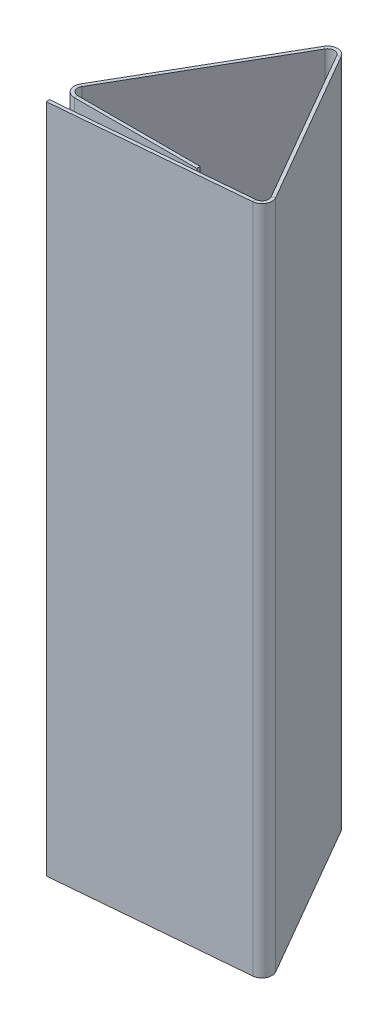
ISO-10303-21;
HEADER;
FILE_DESCRIPTION(('STEP AP214'),'2;1');
FILE_NAME('part.step','',(''),(''),'','','');
FILE_SCHEMA(('AUTOMOTIVE_DESIGN { 1 0 10303 214 1 1 1 1 }'));
ENDSEC;
DATA;
#1=APPLICATION_CONTEXT('core data for automotive mechanical design processes');
#2=APPLICATION_PROTOCOL_DEFINITION('international standard','automotive_design',2000,#1);
#3=PRODUCT_CONTEXT('',#1,'mechanical');
#4=PRODUCT('Part','Part','',(#3));
#5=PRODUCT_RELATED_PRODUCT_CATEGORY('part','',(#4));
#6=PRODUCT_DEFINITION_FORMATION('','',#4);
#7=PRODUCT_DEFINITION_CONTEXT('part definition',#1,'design');
#8=PRODUCT_DEFINITION('design','',#6,#7);
#9=PRODUCT_DEFINITION_SHAPE('','',#8);
#10=(LENGTH_UNIT() NAMED_UNIT(*) SI_UNIT(.MILLI.,.METRE.));
#11=(NAMED_UNIT(*) PLANE_ANGLE_UNIT() SI_UNIT($,.RADIAN.));
#12=(NAMED_UNIT(*) SI_UNIT($,.STERADIAN.) SOLID_ANGLE_UNIT());
#13=UNCERTAINTY_MEASURE_WITH_UNIT(LENGTH_MEASURE(1.E-05),#10,'distance_accuracy_value','');
#14=(GEOMETRIC_REPRESENTATION_CONTEXT(3) GLOBAL_UNCERTAINTY_ASSIGNED_CONTEXT((#13)) GLOBAL_UNIT_ASSIGNED_CONTEXT((#10,
#11,#12)) REPRESENTATION_CONTEXT('',''));
#15=CARTESIAN_POINT('',(0.,0.,0.));
#16=DIRECTION('',(0.,0.,1.));
#17=DIRECTION('',(1.,0.,0.));
#18=AXIS2_PLACEMENT_3D('',#15,#16,#17);
#19=CARTESIAN_POINT('',(14.6075786057206,50.,-0.679693792868908));
#20=DIRECTION('',(0.,1.,0.));
#21=DIRECTION('',(0.,0.,1.));
#22=AXIS2_PLACEMENT_3D('',#19,#20,#21);
#23=PLANE('',#22);
#24=DIRECTION('',(0.866025403784442,0.,-0.499999999999993));
#25=VECTOR('',#24,1.);
#26=CARTESIAN_POINT('',(14.6075786057206,50.,-0.679693792868908));
#27=LINE('',#26,#25);
#28=CARTESIAN_POINT('',(14.6075786057206,50.,-0.679693792868908));
#29=VERTEX_POINT('',#28);
#30=CARTESIAN_POINT('',(14.8240849566667,50.,-0.804693792868906));
#31=VERTEX_POINT('',#30);
#32=EDGE_CURVE('E11',#29,#31,#27,.T.);
#33=ORIENTED_EDGE('',*,*,#32,.F.);
#34=CARTESIAN_POINT('',(14.1745659038283,50.,-0.429693792868902));
#35=DIRECTION('',(0.,-1.,0.));
#36=DIRECTION('',(0.,0.,-1.));
#37=AXIS2_PLACEMENT_3D('',#34,#35,#36);
#38=CIRCLE('',#37,0.5);
#39=CARTESIAN_POINT('',(14.2181437752022,50.,0.0684035561769696));
#40=VERTEX_POINT('',#39);
#41=EDGE_CURVE('E308',#40,#29,#38,.F.);
#42=ORIENTED_EDGE('',*,*,#41,.F.);
#43=DIRECTION('',(-0.0871557427476462,0.,-0.996194698091747));
#44=VECTOR('',#43,1.);
#45=CARTESIAN_POINT('',(14.2399327108891,50.,0.317452230699908));
#46=LINE('',#45,#44);
#47=CARTESIAN_POINT('',(14.2399327108891,50.,0.317452230699908));
#48=VERTEX_POINT('',#47);
#49=EDGE_CURVE('E43',#48,#40,#46,.T.);
#50=ORIENTED_EDGE('',*,*,#49,.F.);
#51=CARTESIAN_POINT('',(14.1745659038283,50.,-0.429693792868902));
#52=DIRECTION('',(0.,1.,0.));
#53=DIRECTION('',(1.,0.,0.));
#54=AXIS2_PLACEMENT_3D('',#51,#52,#53);
#55=CIRCLE('',#54,0.75);
#56=EDGE_CURVE('E321',#48,#31,#55,.T.);
#57=ORIENTED_EDGE('',*,*,#56,.T.);
#58=EDGE_LOOP('',(#33,#42,#50,#57));
#59=FACE_BOUND('',#58,.T.);
#60=ADVANCED_FACE('F35',(#59),#23,.T.);
#61=CARTESIAN_POINT('',(14.2399327108891,50.,0.317452230699908));
#62=DIRECTION('',(0.,1.,0.));
#63=DIRECTION('',(0.,0.,1.));
#64=AXIS2_PLACEMENT_3D('',#61,#62,#63);
#65=PLANE('',#64);
#66=DIRECTION('',(-0.499999999999998,0.,-0.86602540378444));
#67=VECTOR('',#66,1.);
#68=CARTESIAN_POINT('',(7.49999999999997,50.,-12.9903810567666));
#69=LINE('',#68,#67);
#70=CARTESIAN_POINT('',(7.93301270189219,50.,-12.2403810567666));
#71=VERTEX_POINT('',#70);
#72=EDGE_CURVE('E312',#29,#71,#69,.T.);
#73=ORIENTED_EDGE('',*,*,#72,.F.);
#74=ORIENTED_EDGE('',*,*,#32,.T.);
#75=DIRECTION('',(-0.499999999999998,0.,-0.86602540378444));
#76=VECTOR('',#75,1.);
#77=CARTESIAN_POINT('',(7.71650635094608,50.,-13.1153810567666));
#78=LINE('',#77,#76);
#79=CARTESIAN_POINT('',(8.1495190528383,50.,-12.3653810567666));
#80=VERTEX_POINT('',#79);
#81=EDGE_CURVE('E178',#31,#80,#78,.T.);
#82=ORIENTED_EDGE('',*,*,#81,.T.);
#83=DIRECTION('',(-0.866025403784439,0.,0.499999999999998));
#84=VECTOR('',#83,1.);
#85=CARTESIAN_POINT('',(8.1495190528383,50.,-12.3653810567666));
#86=LINE('',#85,#84);
#87=EDGE_CURVE('E169',#80,#71,#86,.T.);
#88=ORIENTED_EDGE('',*,*,#87,.T.);
#89=EDGE_LOOP('',(#73,#74,#82,#88));
#90=FACE_BOUND('',#89,.T.);
#91=ADVANCED_FACE('F326',(#90),#65,.T.);
#92=CARTESIAN_POINT('',(14.2181437752022,0.,0.0684035561769696));
#93=DIRECTION('',(0.,-1.,0.));
#94=DIRECTION('',(0.,0.,-1.));
#95=AXIS2_PLACEMENT_3D('',#92,#93,#94);
#96=PLANE('',#95);
#97=DIRECTION('',(0.0871557427476462,0.,0.996194698091747));
#98=VECTOR('',#97,1.);
#99=CARTESIAN_POINT('',(14.2181437752022,0.,0.0684035561769696));
#100=LINE('',#99,#98);
#101=CARTESIAN_POINT('',(14.2181437752022,0.,0.0684035561769696));
#102=VERTEX_POINT('',#101);
#103=CARTESIAN_POINT('',(14.2399327108891,0.,0.317452230699908));
#104=VERTEX_POINT('',#103);
#105=EDGE_CURVE('E288',#102,#104,#100,.T.);
#106=ORIENTED_EDGE('',*,*,#105,.F.);
#107=CARTESIAN_POINT('',(14.1745659038283,0.,-0.429693792868902));
#108=DIRECTION('',(0.,-1.,0.));
#109=DIRECTION('',(0.,0.,-1.));
#110=AXIS2_PLACEMENT_3D('',#107,#108,#109);
#111=CIRCLE('',#110,0.5);
#112=CARTESIAN_POINT('',(14.6075786057206,0.,-0.679693792868908));
#113=VERTEX_POINT('',#112);
#114=EDGE_CURVE('E218',#102,#113,#111,.F.);
#115=ORIENTED_EDGE('',*,*,#114,.T.);
#116=DIRECTION('',(-0.866025403784442,0.,0.499999999999993));
#117=VECTOR('',#116,1.);
#118=CARTESIAN_POINT('',(14.8240849566667,0.,-0.804693792868906));
#119=LINE('',#118,#117);
#120=CARTESIAN_POINT('',(14.8240849566667,0.,-0.804693792868906));
#121=VERTEX_POINT('',#120);
#122=EDGE_CURVE('E168',#121,#113,#119,.T.);
#123=ORIENTED_EDGE('',*,*,#122,.F.);
#124=CARTESIAN_POINT('',(14.1745659038283,0.,-0.429693792868902));
#125=DIRECTION('',(0.,1.,0.));
#126=DIRECTION('',(1.,0.,0.));
#127=AXIS2_PLACEMENT_3D('',#124,#125,#126);
#128=CIRCLE('',#127,0.75);
#129=EDGE_CURVE('E230',#104,#121,#128,.T.);
#130=ORIENTED_EDGE('',*,*,#129,.F.);
#131=EDGE_LOOP('',(#106,#115,#123,#130));
#132=FACE_BOUND('',#131,.T.);
#133=ADVANCED_FACE('F378',(#132),#96,.T.);
#134=CARTESIAN_POINT('',(14.8240849566667,0.,-0.804693792868906));
#135=DIRECTION('',(0.,-1.,0.));
#136=DIRECTION('',(0.,0.,-1.));
#137=AXIS2_PLACEMENT_3D('',#134,#135,#136);
#138=PLANE('',#137);
#139=DIRECTION('',(0.996194698091746,0.,-0.0871557427476513));
#140=VECTOR('',#139,1.);
#141=CARTESIAN_POINT('',(14.9999999999999,0.,0.));
#142=LINE('',#141,#140);
#143=CARTESIAN_POINT('',(0.0570795286237505,0.,1.30733614121476));
#144=VERTEX_POINT('',#143);
#145=EDGE_CURVE('E221',#144,#102,#142,.T.);
#146=ORIENTED_EDGE('',*,*,#145,.T.);
#147=ORIENTED_EDGE('',*,*,#105,.T.);
#148=DIRECTION('',(0.996194698091746,0.,-0.0871557427476513));
#149=VECTOR('',#148,1.);
#150=CARTESIAN_POINT('',(15.0217889356869,0.,0.249048674522931));
#151=LINE('',#150,#149);
#152=CARTESIAN_POINT('',(0.0788684643106621,0.,1.5563848157377));
#153=VERTEX_POINT('',#152);
#154=EDGE_CURVE('E227',#153,#104,#151,.T.);
#155=ORIENTED_EDGE('',*,*,#154,.F.);
#156=DIRECTION('',(-0.0871557427476467,0.,-0.996194698091747));
#157=VECTOR('',#156,1.);
#158=CARTESIAN_POINT('',(0.0788684643106621,0.,1.5563848157377));
#159=LINE('',#158,#157);
#160=EDGE_CURVE('E224',#153,#144,#159,.T.);
#161=ORIENTED_EDGE('',*,*,#160,.T.);
#162=EDGE_LOOP('',(#146,#147,#155,#161));
#163=FACE_BOUND('',#162,.T.);
#164=ADVANCED_FACE('F382',(#163),#138,.T.);
#165=CARTESIAN_POINT('',(7.06698729810775,50.,-12.2403810567666));
#166=DIRECTION('',(0.,1.,0.));
#167=DIRECTION('',(0.,0.,1.));
#168=AXIS2_PLACEMENT_3D('',#165,#166,#167);
#169=PLANE('',#168);
#170=DIRECTION('',(-0.866025403784436,0.,-0.500000000000005));
#171=VECTOR('',#170,1.);
#172=CARTESIAN_POINT('',(7.06698729810775,50.,-12.2403810567666));
#173=LINE('',#172,#171);
#174=CARTESIAN_POINT('',(7.06698729810775,50.,-12.2403810567666));
#175=VERTEX_POINT('',#174);
#176=CARTESIAN_POINT('',(6.85048094716164,50.,-12.3653810567666));
#177=VERTEX_POINT('',#176);
#178=EDGE_CURVE('E156',#175,#177,#173,.T.);
#179=ORIENTED_EDGE('',*,*,#178,.F.);
#180=CARTESIAN_POINT('',(7.49999999999997,50.,-11.9903810567666));
#181=DIRECTION('',(0.,-1.,0.));
#182=DIRECTION('',(0.,0.,-1.));
#183=AXIS2_PLACEMENT_3D('',#180,#181,#182);
#184=CIRCLE('',#183,0.5);
#185=EDGE_CURVE('E338',#71,#175,#184,.F.);
#186=ORIENTED_EDGE('',*,*,#185,.F.);
#187=ORIENTED_EDGE('',*,*,#87,.F.);
#188=CARTESIAN_POINT('',(7.49999999999997,50.,-11.9903810567666));
#189=DIRECTION('',(0.,1.,0.));
#190=DIRECTION('',(1.,0.,0.));
#191=AXIS2_PLACEMENT_3D('',#188,#189,#190);
#192=CIRCLE('',#191,0.75);
#193=EDGE_CURVE('E172',#80,#177,#192,.T.);
#194=ORIENTED_EDGE('',*,*,#193,.T.);
#195=EDGE_LOOP('',(#179,#186,#187,#194));
#196=FACE_BOUND('',#195,.T.);
#197=ADVANCED_FACE('F174',(#196),#169,.T.);
#198=CARTESIAN_POINT('',(8.1495190528383,50.,-12.3653810567666));
#199=DIRECTION('',(0.,1.,0.));
#200=DIRECTION('',(0.,0.,1.));
#201=AXIS2_PLACEMENT_3D('',#198,#199,#200);
#202=PLANE('',#201);
#203=DIRECTION('',(-0.499999999999998,0.,0.86602540378444));
#204=VECTOR('',#203,1.);
#205=CARTESIAN_POINT('',(0.,50.,0.));
#206=LINE('',#205,#204);
#207=CARTESIAN_POINT('',(0.433012701892216,50.,-0.749999999999999));
#208=VERTEX_POINT('',#207);
#209=EDGE_CURVE('E163',#175,#208,#206,.T.);
#210=ORIENTED_EDGE('',*,*,#209,.F.);
#211=ORIENTED_EDGE('',*,*,#178,.T.);
#212=DIRECTION('',(-0.499999999999998,0.,0.86602540378444));
#213=VECTOR('',#212,1.);
#214=CARTESIAN_POINT('',(-0.21650635094611,50.,-0.124999999999999));
#215=LINE('',#214,#213);
#216=CARTESIAN_POINT('',(0.216506350946106,50.,-0.874999999999998));
#217=VERTEX_POINT('',#216);
#218=EDGE_CURVE('E160',#177,#217,#215,.T.);
#219=ORIENTED_EDGE('',*,*,#218,.T.);
#220=DIRECTION('',(0.86602540378444,0.,0.499999999999997));
#221=VECTOR('',#220,1.);
#222=CARTESIAN_POINT('',(0.216506350946106,50.,-0.874999999999998));
#223=LINE('',#222,#221);
#224=EDGE_CURVE('E279',#217,#208,#223,.T.);
#225=ORIENTED_EDGE('',*,*,#224,.T.);
#226=EDGE_LOOP('',(#210,#211,#219,#225));
#227=FACE_BOUND('',#226,.T.);
#228=ADVANCED_FACE('F158',(#227),#202,.T.);
#229=CARTESIAN_POINT('',(7.93301270189219,0.,-12.2403810567666));
#230=DIRECTION('',(0.,-1.,0.));
#231=DIRECTION('',(0.,0.,-1.));
#232=AXIS2_PLACEMENT_3D('',#229,#230,#231);
#233=PLANE('',#232);
#234=DIRECTION('',(0.866025403784439,0.,-0.499999999999998));
#235=VECTOR('',#234,1.);
#236=CARTESIAN_POINT('',(7.93301270189219,0.,-12.2403810567666));
#237=LINE('',#236,#235);
#238=CARTESIAN_POINT('',(7.93301270189219,0.,-12.2403810567666));
#239=VERTEX_POINT('',#238);
#240=CARTESIAN_POINT('',(8.1495190528383,0.,-12.3653810567666));
#241=VERTEX_POINT('',#240);
#242=EDGE_CURVE('E284',#239,#241,#237,.T.);
#243=ORIENTED_EDGE('',*,*,#242,.F.);
#244=CARTESIAN_POINT('',(7.49999999999997,0.,-11.9903810567666));
#245=DIRECTION('',(0.,-1.,0.));
#246=DIRECTION('',(0.,0.,-1.));
#247=AXIS2_PLACEMENT_3D('',#244,#245,#246);
#248=CIRCLE('',#247,0.5);
#249=CARTESIAN_POINT('',(7.06698729810775,0.,-12.2403810567666));
#250=VERTEX_POINT('',#249);
#251=EDGE_CURVE('E212',#239,#250,#248,.F.);
#252=ORIENTED_EDGE('',*,*,#251,.T.);
#253=DIRECTION('',(0.866025403784436,0.,0.500000000000005));
#254=VECTOR('',#253,1.);
#255=CARTESIAN_POINT('',(6.85048094716164,0.,-12.3653810567666));
#256=LINE('',#255,#254);
#257=CARTESIAN_POINT('',(6.85048094716164,0.,-12.3653810567666));
#258=VERTEX_POINT('',#257);
#259=EDGE_CURVE('E282',#258,#250,#256,.T.);
#260=ORIENTED_EDGE('',*,*,#259,.F.);
#261=CARTESIAN_POINT('',(7.49999999999997,0.,-11.9903810567666));
#262=DIRECTION('',(0.,1.,0.));
#263=DIRECTION('',(1.,0.,0.));
#264=AXIS2_PLACEMENT_3D('',#261,#262,#263);
#265=CIRCLE('',#264,0.75);
#266=EDGE_CURVE('E185',#241,#258,#265,.T.);
#267=ORIENTED_EDGE('',*,*,#266,.F.);
#268=EDGE_LOOP('',(#243,#252,#260,#267));
#269=FACE_BOUND('',#268,.T.);
#270=ADVANCED_FACE('F332',(#269),#233,.T.);
#271=CARTESIAN_POINT('',(6.85048094716164,0.,-12.3653810567666));
#272=DIRECTION('',(0.,-1.,0.));
#273=DIRECTION('',(0.,0.,-1.));
#274=AXIS2_PLACEMENT_3D('',#271,#272,#273);
#275=PLANE('',#274);
#276=DIRECTION('',(-0.499999999999998,0.,-0.86602540378444));
#277=VECTOR('',#276,1.);
#278=CARTESIAN_POINT('',(7.49999999999997,0.,-12.9903810567666));
#279=LINE('',#278,#277);
#280=EDGE_CURVE('E215',#113,#239,#279,.T.);
#281=ORIENTED_EDGE('',*,*,#280,.T.);
#282=ORIENTED_EDGE('',*,*,#242,.T.);
#283=DIRECTION('',(-0.499999999999998,0.,-0.86602540378444));
#284=VECTOR('',#283,1.);
#285=CARTESIAN_POINT('',(7.71650635094608,0.,-13.1153810567666));
#286=LINE('',#285,#284);
#287=EDGE_CURVE('E233',#121,#241,#286,.T.);
#288=ORIENTED_EDGE('',*,*,#287,.F.);
#289=ORIENTED_EDGE('',*,*,#122,.T.);
#290=EDGE_LOOP('',(#281,#282,#288,#289));
#291=FACE_BOUND('',#290,.T.);
#292=ADVANCED_FACE('F390',(#291),#275,.T.);
#293=CARTESIAN_POINT('',(0.866025403784436,50.,0.));
#294=DIRECTION('',(0.,1.,0.));
#295=DIRECTION('',(0.,0.,1.));
#296=AXIS2_PLACEMENT_3D('',#293,#294,#295);
#297=PLANE('',#296);
#298=DIRECTION('',(0.,0.,1.));
#299=VECTOR('',#298,1.);
#300=CARTESIAN_POINT('',(0.866025403784436,50.,0.));
#301=LINE('',#300,#299);
#302=CARTESIAN_POINT('',(0.866025403784436,50.,0.));
#303=VERTEX_POINT('',#302);
#304=CARTESIAN_POINT('',(0.866025403784436,50.,0.25));
#305=VERTEX_POINT('',#304);
#306=EDGE_CURVE('E51',#303,#305,#301,.T.);
#307=ORIENTED_EDGE('',*,*,#306,.F.);
#308=CARTESIAN_POINT('',(0.866025403784436,50.,-0.5));
#309=DIRECTION('',(0.,-1.,0.));
#310=DIRECTION('',(0.,0.,-1.));
#311=AXIS2_PLACEMENT_3D('',#308,#309,#310);
#312=CIRCLE('',#311,0.5);
#313=EDGE_CURVE('E366',#208,#303,#312,.F.);
#314=ORIENTED_EDGE('',*,*,#313,.F.);
#315=ORIENTED_EDGE('',*,*,#224,.F.);
#316=CARTESIAN_POINT('',(0.866025403784436,50.,-0.5));
#317=DIRECTION('',(0.,1.,0.));
#318=DIRECTION('',(1.,0.,0.));
#319=AXIS2_PLACEMENT_3D('',#316,#317,#318);
#320=CIRCLE('',#319,0.75);
#321=EDGE_CURVE('E193',#217,#305,#320,.T.);
#322=ORIENTED_EDGE('',*,*,#321,.T.);
#323=EDGE_LOOP('',(#307,#314,#315,#322));
#324=FACE_BOUND('',#323,.T.);
#325=ADVANCED_FACE('F392',(#324),#297,.T.);
#326=CARTESIAN_POINT('',(0.216506350946106,50.,-0.874999999999998));
#327=DIRECTION('',(0.,1.,0.));
#328=DIRECTION('',(0.,0.,1.));
#329=AXIS2_PLACEMENT_3D('',#326,#327,#328);
#330=PLANE('',#329);
#331=DIRECTION('',(1.,0.,0.));
#332=VECTOR('',#331,1.);
#333=CARTESIAN_POINT('',(0.,50.,0.));
#334=LINE('',#333,#332);
#335=CARTESIAN_POINT('',(10.,50.,0.));
#336=VERTEX_POINT('',#335);
#337=EDGE_CURVE('E364',#303,#336,#334,.T.);
#338=ORIENTED_EDGE('',*,*,#337,.F.);
#339=ORIENTED_EDGE('',*,*,#306,.T.);
#340=DIRECTION('',(1.,0.,0.));
#341=VECTOR('',#340,1.);
#342=CARTESIAN_POINT('',(0.,50.,0.25));
#343=LINE('',#342,#341);
#344=CARTESIAN_POINT('',(10.,50.,0.25));
#345=VERTEX_POINT('',#344);
#346=EDGE_CURVE('E117',#305,#345,#343,.T.);
#347=ORIENTED_EDGE('',*,*,#346,.T.);
#348=DIRECTION('',(0.,0.,1.));
#349=VECTOR('',#348,1.);
#350=CARTESIAN_POINT('',(10.,50.,0.));
#351=LINE('',#350,#349);
#352=EDGE_CURVE('E362',#336,#345,#351,.T.);
#353=ORIENTED_EDGE('',*,*,#352,.F.);
#354=EDGE_LOOP('',(#338,#339,#347,#353));
#355=FACE_BOUND('',#354,.T.);
#356=ADVANCED_FACE('F398',(#355),#330,.T.);
#357=CARTESIAN_POINT('',(0.433012701892216,0.,-0.749999999999999));
#358=DIRECTION('',(0.,-1.,0.));
#359=DIRECTION('',(0.,0.,-1.));
#360=AXIS2_PLACEMENT_3D('',#357,#358,#359);
#361=PLANE('',#360);
#362=DIRECTION('',(-0.86602540378444,0.,-0.499999999999997));
#363=VECTOR('',#362,1.);
#364=CARTESIAN_POINT('',(0.433012701892216,0.,-0.749999999999999));
#365=LINE('',#364,#363);
#366=CARTESIAN_POINT('',(0.433012701892216,0.,-0.749999999999999));
#367=VERTEX_POINT('',#366);
#368=CARTESIAN_POINT('',(0.216506350946106,0.,-0.874999999999998));
#369=VERTEX_POINT('',#368);
#370=EDGE_CURVE('E104',#367,#369,#365,.T.);
#371=ORIENTED_EDGE('',*,*,#370,.F.);
#372=CARTESIAN_POINT('',(0.866025403784436,0.,-0.5));
#373=DIRECTION('',(0.,-1.,0.));
#374=DIRECTION('',(0.,0.,-1.));
#375=AXIS2_PLACEMENT_3D('',#372,#373,#374);
#376=CIRCLE('',#375,0.5);
#377=CARTESIAN_POINT('',(0.866025403784436,0.,0.));
#378=VERTEX_POINT('',#377);
#379=EDGE_CURVE('E208',#367,#378,#376,.F.);
#380=ORIENTED_EDGE('',*,*,#379,.T.);
#381=DIRECTION('',(0.,0.,-1.));
#382=VECTOR('',#381,1.);
#383=CARTESIAN_POINT('',(0.866025403784436,0.,0.25));
#384=LINE('',#383,#382);
#385=CARTESIAN_POINT('',(0.866025403784436,0.,0.25));
#386=VERTEX_POINT('',#385);
#387=EDGE_CURVE('E111',#386,#378,#384,.T.);
#388=ORIENTED_EDGE('',*,*,#387,.F.);
#389=CARTESIAN_POINT('',(0.866025403784436,0.,-0.5));
#390=DIRECTION('',(0.,1.,0.));
#391=DIRECTION('',(1.,0.,0.));
#392=AXIS2_PLACEMENT_3D('',#389,#390,#391);
#393=CIRCLE('',#392,0.75);
#394=EDGE_CURVE('E239',#369,#386,#393,.T.);
#395=ORIENTED_EDGE('',*,*,#394,.F.);
#396=EDGE_LOOP('',(#371,#380,#388,#395));
#397=FACE_BOUND('',#396,.T.);
#398=ADVANCED_FACE('F349',(#397),#361,.T.);
#399=CARTESIAN_POINT('',(0.866025403784436,0.,0.25));
#400=DIRECTION('',(0.,-1.,0.));
#401=DIRECTION('',(0.,0.,-1.));
#402=AXIS2_PLACEMENT_3D('',#399,#400,#401);
#403=PLANE('',#402);
#404=DIRECTION('',(-0.499999999999998,0.,0.86602540378444));
#405=VECTOR('',#404,1.);
#406=CARTESIAN_POINT('',(0.,0.,0.));
#407=LINE('',#406,#405);
#408=EDGE_CURVE('E210',#250,#367,#407,.T.);
#409=ORIENTED_EDGE('',*,*,#408,.T.);
#410=ORIENTED_EDGE('',*,*,#370,.T.);
#411=DIRECTION('',(-0.499999999999998,0.,0.86602540378444));
#412=VECTOR('',#411,1.);
#413=CARTESIAN_POINT('',(-0.21650635094611,0.,-0.124999999999999));
#414=LINE('',#413,#412);
#415=EDGE_CURVE('E237',#258,#369,#414,.T.);
#416=ORIENTED_EDGE('',*,*,#415,.F.);
#417=ORIENTED_EDGE('',*,*,#259,.T.);
#418=EDGE_LOOP('',(#409,#410,#416,#417));
#419=FACE_BOUND('',#418,.T.);
#420=ADVANCED_FACE('F334',(#419),#403,.T.);
#421=CARTESIAN_POINT('',(0.,50.,0.25));
#422=DIRECTION('',(0.,0.,-1.));
#423=DIRECTION('',(-1.,0.,0.));
#424=AXIS2_PLACEMENT_3D('',#421,#422,#423);
#425=PLANE('',#424);
#426=DIRECTION('',(1.,0.,0.));
#427=VECTOR('',#426,1.);
#428=CARTESIAN_POINT('',(0.,0.,0.25));
#429=LINE('',#428,#427);
#430=CARTESIAN_POINT('',(10.,0.,0.25));
#431=VERTEX_POINT('',#430);
#432=EDGE_CURVE('E199',#386,#431,#429,.T.);
#433=ORIENTED_EDGE('',*,*,#432,.T.);
#434=DIRECTION('',(0.,-1.,0.));
#435=VECTOR('',#434,1.);
#436=CARTESIAN_POINT('',(10.,50.,0.25));
#437=LINE('',#436,#435);
#438=EDGE_CURVE('E275',#345,#431,#437,.T.);
#439=ORIENTED_EDGE('',*,*,#438,.F.);
#440=ORIENTED_EDGE('',*,*,#346,.F.);
#441=DIRECTION('',(0.,-1.,0.));
#442=VECTOR('',#441,1.);
#443=CARTESIAN_POINT('',(0.866025403784436,50.,0.25));
#444=LINE('',#443,#442);
#445=EDGE_CURVE('E195',#305,#386,#444,.T.);
#446=ORIENTED_EDGE('',*,*,#445,.T.);
#447=EDGE_LOOP('',(#433,#439,#440,#446));
#448=FACE_BOUND('',#447,.T.);
#449=ADVANCED_FACE('F355',(#448),#425,.F.);
#450=CARTESIAN_POINT('',(10.,50.,0.));
#451=DIRECTION('',(1.,0.,0.));
#452=DIRECTION('',(0.,0.,-1.));
#453=AXIS2_PLACEMENT_3D('',#450,#451,#452);
#454=PLANE('',#453);
#455=DIRECTION('',(0.,0.,1.));
#456=VECTOR('',#455,1.);
#457=CARTESIAN_POINT('',(10.,0.,0.));
#458=LINE('',#457,#456);
#459=CARTESIAN_POINT('',(10.,0.,0.));
#460=VERTEX_POINT('',#459);
#461=EDGE_CURVE('E202',#460,#431,#458,.T.);
#462=ORIENTED_EDGE('',*,*,#461,.F.);
#463=DIRECTION('',(0.,-1.,0.));
#464=VECTOR('',#463,1.);
#465=CARTESIAN_POINT('',(10.,50.,0.));
#466=LINE('',#465,#464);
#467=EDGE_CURVE('E273',#336,#460,#466,.T.);
#468=ORIENTED_EDGE('',*,*,#467,.F.);
#469=ORIENTED_EDGE('',*,*,#352,.T.);
#470=ORIENTED_EDGE('',*,*,#438,.T.);
#471=EDGE_LOOP('',(#462,#468,#469,#470));
#472=FACE_BOUND('',#471,.T.);
#473=ADVANCED_FACE('F360',(#472),#454,.T.);
#474=CARTESIAN_POINT('',(0.,50.,0.));
#475=DIRECTION('',(0.,0.,-1.));
#476=DIRECTION('',(-1.,0.,0.));
#477=AXIS2_PLACEMENT_3D('',#474,#475,#476);
#478=PLANE('',#477);
#479=DIRECTION('',(1.,0.,0.));
#480=VECTOR('',#479,1.);
#481=CARTESIAN_POINT('',(0.,0.,0.));
#482=LINE('',#481,#480);
#483=EDGE_CURVE('E205',#378,#460,#482,.T.);
#484=ORIENTED_EDGE('',*,*,#483,.F.);
#485=DIRECTION('',(0.,-1.,0.));
#486=VECTOR('',#485,1.);
#487=CARTESIAN_POINT('',(0.866025403784436,50.,0.));
#488=LINE('',#487,#486);
#489=EDGE_CURVE('E270',#303,#378,#488,.T.);
#490=ORIENTED_EDGE('',*,*,#489,.F.);
#491=ORIENTED_EDGE('',*,*,#337,.T.);
#492=ORIENTED_EDGE('',*,*,#467,.T.);
#493=EDGE_LOOP('',(#484,#490,#491,#492));
#494=FACE_BOUND('',#493,.T.);
#495=ADVANCED_FACE('F482',(#494),#478,.T.);
#496=CARTESIAN_POINT('',(0.866025403784436,50.,-0.5));
#497=DIRECTION('',(0.,-1.,0.));
#498=DIRECTION('',(0.,0.,-1.));
#499=AXIS2_PLACEMENT_3D('',#496,#497,#498);
#500=CYLINDRICAL_SURFACE('',#499,0.5);
#501=ORIENTED_EDGE('',*,*,#379,.F.);
#502=DIRECTION('',(0.,-1.,0.));
#503=VECTOR('',#502,1.);
#504=CARTESIAN_POINT('',(0.433012701892216,50.,-0.749999999999999));
#505=LINE('',#504,#503);
#506=EDGE_CURVE('E267',#208,#367,#505,.T.);
#507=ORIENTED_EDGE('',*,*,#506,.F.);
#508=ORIENTED_EDGE('',*,*,#313,.T.);
#509=ORIENTED_EDGE('',*,*,#489,.T.);
#510=EDGE_LOOP('',(#501,#507,#508,#509));
#511=FACE_BOUND('',#510,.T.);
#512=ADVANCED_FACE('F346',(#511),#500,.F.);
#513=CARTESIAN_POINT('',(0.,50.,0.));
#514=DIRECTION('',(0.86602540378444,0.,0.499999999999998));
#515=DIRECTION('',(0.499999999999998,0.,-0.86602540378444));
#516=AXIS2_PLACEMENT_3D('',#513,#514,#515);
#517=PLANE('',#516);
#518=ORIENTED_EDGE('',*,*,#408,.F.);
#519=DIRECTION('',(0.,-1.,0.));
#520=VECTOR('',#519,1.);
#521=CARTESIAN_POINT('',(7.06698729810775,50.,-12.2403810567666));
#522=LINE('',#521,#520);
#523=EDGE_CURVE('E264',#175,#250,#522,.T.);
#524=ORIENTED_EDGE('',*,*,#523,.F.);
#525=ORIENTED_EDGE('',*,*,#209,.T.);
#526=ORIENTED_EDGE('',*,*,#506,.T.);
#527=EDGE_LOOP('',(#518,#524,#525,#526));
#528=FACE_BOUND('',#527,.T.);
#529=ADVANCED_FACE('F340',(#528),#517,.T.);
#530=CARTESIAN_POINT('',(7.49999999999997,50.,-11.9903810567666));
#531=DIRECTION('',(0.,-1.,0.));
#532=DIRECTION('',(0.,0.,-1.));
#533=AXIS2_PLACEMENT_3D('',#530,#531,#532);
#534=CYLINDRICAL_SURFACE('',#533,0.5);
#535=ORIENTED_EDGE('',*,*,#251,.F.);
#536=DIRECTION('',(0.,-1.,0.));
#537=VECTOR('',#536,1.);
#538=CARTESIAN_POINT('',(7.93301270189219,50.,-12.2403810567666));
#539=LINE('',#538,#537);
#540=EDGE_CURVE('E261',#71,#239,#539,.T.);
#541=ORIENTED_EDGE('',*,*,#540,.F.);
#542=ORIENTED_EDGE('',*,*,#185,.T.);
#543=ORIENTED_EDGE('',*,*,#523,.T.);
#544=EDGE_LOOP('',(#535,#541,#542,#543));
#545=FACE_BOUND('',#544,.T.);
#546=ADVANCED_FACE('F337',(#545),#534,.F.);
#547=CARTESIAN_POINT('',(7.49999999999997,50.,-12.9903810567666));
#548=DIRECTION('',(-0.86602540378444,0.,0.499999999999998));
#549=DIRECTION('',(0.499999999999998,0.,0.86602540378444));
#550=AXIS2_PLACEMENT_3D('',#547,#548,#549);
#551=PLANE('',#550);
#552=ORIENTED_EDGE('',*,*,#280,.F.);
#553=DIRECTION('',(0.,-1.,0.));
#554=VECTOR('',#553,1.);
#555=CARTESIAN_POINT('',(14.6075786057206,50.,-0.679693792868908));
#556=LINE('',#555,#554);
#557=EDGE_CURVE('E258',#29,#113,#556,.T.);
#558=ORIENTED_EDGE('',*,*,#557,.F.);
#559=ORIENTED_EDGE('',*,*,#72,.T.);
#560=ORIENTED_EDGE('',*,*,#540,.T.);
#561=EDGE_LOOP('',(#552,#558,#559,#560));
#562=FACE_BOUND('',#561,.T.);
#563=ADVANCED_FACE('F375',(#562),#551,.T.);
#564=CARTESIAN_POINT('',(14.1745659038283,50.,-0.429693792868902));
#565=DIRECTION('',(0.,-1.,0.));
#566=DIRECTION('',(0.,0.,-1.));
#567=AXIS2_PLACEMENT_3D('',#564,#565,#566);
#568=CYLINDRICAL_SURFACE('',#567,0.5);
#569=ORIENTED_EDGE('',*,*,#114,.F.);
#570=DIRECTION('',(0.,-1.,0.));
#571=VECTOR('',#570,1.);
#572=CARTESIAN_POINT('',(14.2181437752022,50.,0.0684035561769696));
#573=LINE('',#572,#571);
#574=EDGE_CURVE('E255',#40,#102,#573,.T.);
#575=ORIENTED_EDGE('',*,*,#574,.F.);
#576=ORIENTED_EDGE('',*,*,#41,.T.);
#577=ORIENTED_EDGE('',*,*,#557,.T.);
#578=EDGE_LOOP('',(#569,#575,#576,#577));
#579=FACE_BOUND('',#578,.T.);
#580=ADVANCED_FACE('F307',(#579),#568,.F.);
#581=CARTESIAN_POINT('',(14.9999999999999,50.,0.));
#582=DIRECTION('',(-0.0871557427476513,0.,-0.996194698091746));
#583=DIRECTION('',(-0.996194698091746,0.,0.0871557427476513));
#584=AXIS2_PLACEMENT_3D('',#581,#582,#583);
#585=PLANE('',#584);
#586=ORIENTED_EDGE('',*,*,#145,.F.);
#587=DIRECTION('',(0.,-1.,0.));
#588=VECTOR('',#587,1.);
#589=CARTESIAN_POINT('',(0.0570795286237505,50.,1.30733614121476));
#590=LINE('',#589,#588);
#591=CARTESIAN_POINT('',(0.0570795286237505,50.,1.30733614121476));
#592=VERTEX_POINT('',#591);
#593=EDGE_CURVE('E253',#592,#144,#590,.T.);
#594=ORIENTED_EDGE('',*,*,#593,.F.);
#595=DIRECTION('',(0.996194698091746,0.,-0.0871557427476513));
#596=VECTOR('',#595,1.);
#597=CARTESIAN_POINT('',(14.9999999999999,50.,0.));
#598=LINE('',#597,#596);
#599=EDGE_CURVE('E296',#592,#40,#598,.T.);
#600=ORIENTED_EDGE('',*,*,#599,.T.);
#601=ORIENTED_EDGE('',*,*,#574,.T.);
#602=EDGE_LOOP('',(#586,#594,#600,#601));
#603=FACE_BOUND('',#602,.T.);
#604=ADVANCED_FACE('F314',(#603),#585,.T.);
#605=CARTESIAN_POINT('',(0.0788684643106621,50.,1.5563848157377));
#606=DIRECTION('',(-0.996194698091747,0.,0.0871557427476467));
#607=DIRECTION('',(0.0871557427476467,0.,0.996194698091747));
#608=AXIS2_PLACEMENT_3D('',#605,#606,#607);
#609=PLANE('',#608);
#610=ORIENTED_EDGE('',*,*,#160,.F.);
#611=DIRECTION('',(0.,-1.,0.));
#612=VECTOR('',#611,1.);
#613=CARTESIAN_POINT('',(0.0788684643106621,50.,1.5563848157377));
#614=LINE('',#613,#612);
#615=CARTESIAN_POINT('',(0.0788684643106621,50.,1.5563848157377));
#616=VERTEX_POINT('',#615);
#617=EDGE_CURVE('E251',#616,#153,#614,.T.);
#618=ORIENTED_EDGE('',*,*,#617,.F.);
#619=DIRECTION('',(-0.0871557427476467,0.,-0.996194698091747));
#620=VECTOR('',#619,1.);
#621=CARTESIAN_POINT('',(0.0788684643106621,50.,1.5563848157377));
#622=LINE('',#621,#620);
#623=EDGE_CURVE('E315',#616,#592,#622,.T.);
#624=ORIENTED_EDGE('',*,*,#623,.T.);
#625=ORIENTED_EDGE('',*,*,#593,.T.);
#626=EDGE_LOOP('',(#610,#618,#624,#625));
#627=FACE_BOUND('',#626,.T.);
#628=ADVANCED_FACE('F547',(#627),#609,.T.);
#629=CARTESIAN_POINT('',(15.0217889356869,50.,0.249048674522931));
#630=DIRECTION('',(-0.0871557427476513,0.,-0.996194698091746));
#631=DIRECTION('',(-0.996194698091746,0.,0.0871557427476513));
#632=AXIS2_PLACEMENT_3D('',#629,#630,#631);
#633=PLANE('',#632);
#634=ORIENTED_EDGE('',*,*,#154,.T.);
#635=DIRECTION('',(0.,-1.,0.));
#636=VECTOR('',#635,1.);
#637=CARTESIAN_POINT('',(14.2399327108891,50.,0.317452230699908));
#638=LINE('',#637,#636);
#639=EDGE_CURVE('E248',#48,#104,#638,.T.);
#640=ORIENTED_EDGE('',*,*,#639,.F.);
#641=DIRECTION('',(0.996194698091746,0.,-0.0871557427476513));
#642=VECTOR('',#641,1.);
#643=CARTESIAN_POINT('',(15.0217889356869,50.,0.249048674522931));
#644=LINE('',#643,#642);
#645=EDGE_CURVE('E299',#616,#48,#644,.T.);
#646=ORIENTED_EDGE('',*,*,#645,.F.);
#647=ORIENTED_EDGE('',*,*,#617,.T.);
#648=EDGE_LOOP('',(#634,#640,#646,#647));
#649=FACE_BOUND('',#648,.T.);
#650=ADVANCED_FACE('F385',(#649),#633,.F.);
#651=CARTESIAN_POINT('',(14.1745659038283,50.,-0.429693792868902));
#652=DIRECTION('',(0.,-1.,0.));
#653=DIRECTION('',(0.,0.,-1.));
#654=AXIS2_PLACEMENT_3D('',#651,#652,#653);
#655=CYLINDRICAL_SURFACE('',#654,0.75);
#656=ORIENTED_EDGE('',*,*,#129,.T.);
#657=DIRECTION('',(0.,-1.,0.));
#658=VECTOR('',#657,1.);
#659=CARTESIAN_POINT('',(14.8240849566667,50.,-0.804693792868906));
#660=LINE('',#659,#658);
#661=EDGE_CURVE('E245',#31,#121,#660,.T.);
#662=ORIENTED_EDGE('',*,*,#661,.F.);
#663=ORIENTED_EDGE('',*,*,#56,.F.);
#664=ORIENTED_EDGE('',*,*,#639,.T.);
#665=EDGE_LOOP('',(#656,#662,#663,#664));
#666=FACE_BOUND('',#665,.T.);
#667=ADVANCED_FACE('F388',(#666),#655,.T.);
#668=CARTESIAN_POINT('',(7.71650635094608,50.,-13.1153810567666));
#669=DIRECTION('',(-0.86602540378444,0.,0.499999999999998));
#670=DIRECTION('',(0.499999999999998,0.,0.86602540378444));
#671=AXIS2_PLACEMENT_3D('',#668,#669,#670);
#672=PLANE('',#671);
#673=ORIENTED_EDGE('',*,*,#287,.T.);
#674=DIRECTION('',(0.,-1.,0.));
#675=VECTOR('',#674,1.);
#676=CARTESIAN_POINT('',(8.1495190528383,50.,-12.3653810567666));
#677=LINE('',#676,#675);
#678=EDGE_CURVE('E187',#80,#241,#677,.T.);
#679=ORIENTED_EDGE('',*,*,#678,.F.);
#680=ORIENTED_EDGE('',*,*,#81,.F.);
#681=ORIENTED_EDGE('',*,*,#661,.T.);
#682=EDGE_LOOP('',(#673,#679,#680,#681));
#683=FACE_BOUND('',#682,.T.);
#684=ADVANCED_FACE('F329',(#683),#672,.F.);
#685=CARTESIAN_POINT('',(7.49999999999997,50.,-11.9903810567666));
#686=DIRECTION('',(0.,-1.,0.));
#687=DIRECTION('',(0.,0.,-1.));
#688=AXIS2_PLACEMENT_3D('',#685,#686,#687);
#689=CYLINDRICAL_SURFACE('',#688,0.75);
#690=ORIENTED_EDGE('',*,*,#266,.T.);
#691=DIRECTION('',(0.,-1.,0.));
#692=VECTOR('',#691,1.);
#693=CARTESIAN_POINT('',(6.85048094716164,50.,-12.3653810567666));
#694=LINE('',#693,#692);
#695=EDGE_CURVE('E182',#177,#258,#694,.T.);
#696=ORIENTED_EDGE('',*,*,#695,.F.);
#697=ORIENTED_EDGE('',*,*,#193,.F.);
#698=ORIENTED_EDGE('',*,*,#678,.T.);
#699=EDGE_LOOP('',(#690,#696,#697,#698));
#700=FACE_BOUND('',#699,.T.);
#701=ADVANCED_FACE('F183',(#700),#689,.T.);
#702=CARTESIAN_POINT('',(-0.21650635094611,50.,-0.124999999999999));
#703=DIRECTION('',(0.86602540378444,0.,0.499999999999998));
#704=DIRECTION('',(0.499999999999998,0.,-0.86602540378444));
#705=AXIS2_PLACEMENT_3D('',#702,#703,#704);
#706=PLANE('',#705);
#707=ORIENTED_EDGE('',*,*,#415,.T.);
#708=DIRECTION('',(0.,-1.,0.));
#709=VECTOR('',#708,1.);
#710=CARTESIAN_POINT('',(0.216506350946106,50.,-0.874999999999998));
#711=LINE('',#710,#709);
#712=EDGE_CURVE('E188',#217,#369,#711,.T.);
#713=ORIENTED_EDGE('',*,*,#712,.F.);
#714=ORIENTED_EDGE('',*,*,#218,.F.);
#715=ORIENTED_EDGE('',*,*,#695,.T.);
#716=EDGE_LOOP('',(#707,#713,#714,#715));
#717=FACE_BOUND('',#716,.T.);
#718=ADVANCED_FACE('F190',(#717),#706,.F.);
#719=CARTESIAN_POINT('',(0.866025403784436,50.,-0.5));
#720=DIRECTION('',(0.,-1.,0.));
#721=DIRECTION('',(0.,0.,-1.));
#722=AXIS2_PLACEMENT_3D('',#719,#720,#721);
#723=CYLINDRICAL_SURFACE('',#722,0.75);
#724=ORIENTED_EDGE('',*,*,#394,.T.);
#725=ORIENTED_EDGE('',*,*,#445,.F.);
#726=ORIENTED_EDGE('',*,*,#321,.F.);
#727=ORIENTED_EDGE('',*,*,#712,.T.);
#728=EDGE_LOOP('',(#724,#725,#726,#727));
#729=FACE_BOUND('',#728,.T.);
#730=ADVANCED_FACE('F352',(#729),#723,.T.);
#731=CARTESIAN_POINT('',(0.866025403784436,50.,-0.5));
#732=DIRECTION('',(0.,-1.,0.));
#733=DIRECTION('',(-1.,0.,0.));
#734=AXIS2_PLACEMENT_3D('',#731,#732,#733);
#735=PLANE('',#734);
#736=ORIENTED_EDGE('',*,*,#645,.T.);
#737=ORIENTED_EDGE('',*,*,#49,.T.);
#738=ORIENTED_EDGE('',*,*,#599,.F.);
#739=ORIENTED_EDGE('',*,*,#623,.F.);
#740=EDGE_LOOP('',(#736,#737,#738,#739));
#741=FACE_BOUND('',#740,.T.);
#742=ADVANCED_FACE('F293',(#741),#735,.F.);
#743=CARTESIAN_POINT('',(0.866025403784436,0.,-0.5));
#744=DIRECTION('',(0.,-1.,0.));
#745=DIRECTION('',(-1.,0.,0.));
#746=AXIS2_PLACEMENT_3D('',#743,#744,#745);
#747=PLANE('',#746);
#748=ORIENTED_EDGE('',*,*,#432,.F.);
#749=ORIENTED_EDGE('',*,*,#387,.T.);
#750=ORIENTED_EDGE('',*,*,#483,.T.);
#751=ORIENTED_EDGE('',*,*,#461,.T.);
#752=EDGE_LOOP('',(#748,#749,#750,#751));
#753=FACE_BOUND('',#752,.T.);
#754=ADVANCED_FACE('F357',(#753),#747,.T.);
#755=CLOSED_SHELL('',(#60,#91,#133,#164,#197,#228,#270,#292,#325,#356,#398,#420,#449,#473,#495,
#512,#529,#546,#563,#580,#604,#628,#650,#667,#684,#701,#718,#730,#742,#754));
#756=MANIFOLD_SOLID_BREP('B2',#755);
#757=ADVANCED_BREP_SHAPE_REPRESENTATION('',(#18,#756),#14);
#758=SHAPE_DEFINITION_REPRESENTATION(#9,#757);
ENDSEC;
END-ISO-10303-21;
